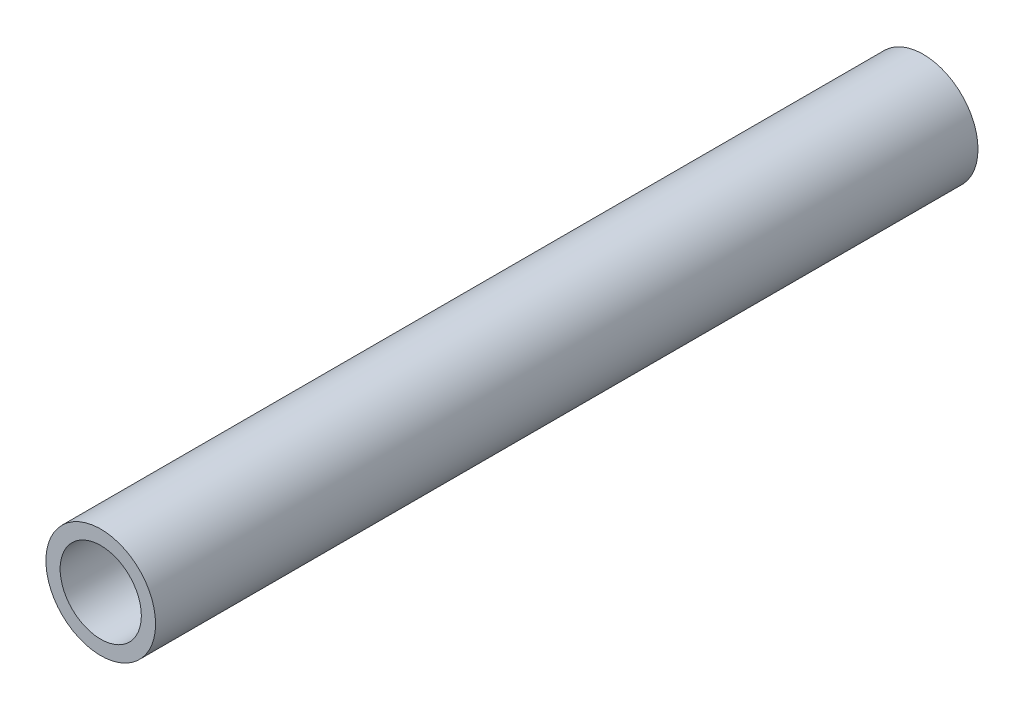
ISO-10303-21;
HEADER;
FILE_DESCRIPTION(('STEP AP214'),'2;1');
FILE_NAME('part.step','',(''),(''),'','','');
FILE_SCHEMA(('AUTOMOTIVE_DESIGN { 1 0 10303 214 1 1 1 1 }'));
ENDSEC;
DATA;
#1=APPLICATION_CONTEXT('core data for automotive mechanical design processes');
#2=APPLICATION_PROTOCOL_DEFINITION('international standard','automotive_design',2000,#1);
#3=PRODUCT_CONTEXT('',#1,'mechanical');
#4=PRODUCT('Part','Part','',(#3));
#5=PRODUCT_RELATED_PRODUCT_CATEGORY('part','',(#4));
#6=PRODUCT_DEFINITION_FORMATION('','',#4);
#7=PRODUCT_DEFINITION_CONTEXT('part definition',#1,'design');
#8=PRODUCT_DEFINITION('design','',#6,#7);
#9=PRODUCT_DEFINITION_SHAPE('','',#8);
#10=(LENGTH_UNIT() NAMED_UNIT(*) SI_UNIT(.MILLI.,.METRE.));
#11=(NAMED_UNIT(*) PLANE_ANGLE_UNIT() SI_UNIT($,.RADIAN.));
#12=(NAMED_UNIT(*) SI_UNIT($,.STERADIAN.) SOLID_ANGLE_UNIT());
#13=UNCERTAINTY_MEASURE_WITH_UNIT(LENGTH_MEASURE(1.E-05),#10,'distance_accuracy_value','');
#14=(GEOMETRIC_REPRESENTATION_CONTEXT(3) GLOBAL_UNCERTAINTY_ASSIGNED_CONTEXT((#13)) GLOBAL_UNIT_ASSIGNED_CONTEXT((#10,
#11,#12)) REPRESENTATION_CONTEXT('',''));
#15=CARTESIAN_POINT('',(0.,0.,0.));
#16=DIRECTION('',(0.,0.,1.));
#17=DIRECTION('',(1.,0.,0.));
#18=AXIS2_PLACEMENT_3D('',#15,#16,#17);
#19=CARTESIAN_POINT('',(0.,0.,80.));
#20=DIRECTION('',(0.,0.,1.));
#21=DIRECTION('',(1.,0.,0.));
#22=AXIS2_PLACEMENT_3D('',#19,#20,#21);
#23=PLANE('',#22);
#24=CARTESIAN_POINT('',(0.,0.,80.));
#25=DIRECTION('',(0.,0.,1.));
#26=DIRECTION('',(1.,0.,0.));
#27=AXIS2_PLACEMENT_3D('',#24,#25,#26);
#28=CIRCLE('',#27,10.668);
#29=CARTESIAN_POINT('',(10.668,0.,80.));
#30=VERTEX_POINT('',#29);
#31=EDGE_CURVE('E11',#30,#30,#28,.T.);
#32=ORIENTED_EDGE('',*,*,#31,.T.);
#33=EDGE_LOOP('',(#32));
#34=FACE_BOUND('',#33,.T.);
#35=CARTESIAN_POINT('',(0.,0.,80.));
#36=DIRECTION('',(0.,0.,1.));
#37=DIRECTION('',(1.,0.,0.));
#38=AXIS2_PLACEMENT_3D('',#35,#36,#37);
#39=CIRCLE('',#38,7.8994);
#40=CARTESIAN_POINT('',(7.8994,0.,80.));
#41=VERTEX_POINT('',#40);
#42=EDGE_CURVE('E50',#41,#41,#39,.T.);
#43=ORIENTED_EDGE('',*,*,#42,.F.);
#44=EDGE_LOOP('',(#43));
#45=FACE_BOUND('',#44,.T.);
#46=ADVANCED_FACE('F39',(#34,#45),#23,.T.);
#47=CARTESIAN_POINT('',(0.,0.,-80.));
#48=DIRECTION('',(0.,0.,1.));
#49=DIRECTION('',(1.,0.,0.));
#50=AXIS2_PLACEMENT_3D('',#47,#48,#49);
#51=PLANE('',#50);
#52=CARTESIAN_POINT('',(0.,0.,-80.));
#53=DIRECTION('',(0.,0.,1.));
#54=DIRECTION('',(1.,0.,0.));
#55=AXIS2_PLACEMENT_3D('',#52,#53,#54);
#56=CIRCLE('',#55,10.668);
#57=CARTESIAN_POINT('',(10.668,0.,-80.));
#58=VERTEX_POINT('',#57);
#59=EDGE_CURVE('E43',#58,#58,#56,.T.);
#60=ORIENTED_EDGE('',*,*,#59,.F.);
#61=EDGE_LOOP('',(#60));
#62=FACE_BOUND('',#61,.T.);
#63=CARTESIAN_POINT('',(0.,0.,-80.));
#64=DIRECTION('',(0.,0.,1.));
#65=DIRECTION('',(1.,0.,0.));
#66=AXIS2_PLACEMENT_3D('',#63,#64,#65);
#67=CIRCLE('',#66,7.8994);
#68=CARTESIAN_POINT('',(7.8994,0.,-80.));
#69=VERTEX_POINT('',#68);
#70=EDGE_CURVE('E52',#69,#69,#67,.T.);
#71=ORIENTED_EDGE('',*,*,#70,.T.);
#72=EDGE_LOOP('',(#71));
#73=FACE_BOUND('',#72,.T.);
#74=ADVANCED_FACE('F62',(#62,#73),#51,.F.);
#75=CARTESIAN_POINT('',(0.,0.,80.));
#76=DIRECTION('',(0.,0.,-1.));
#77=DIRECTION('',(-1.,0.,0.));
#78=AXIS2_PLACEMENT_3D('',#75,#76,#77);
#79=CYLINDRICAL_SURFACE('',#78,10.668);
#80=ORIENTED_EDGE('',*,*,#31,.F.);
#81=EDGE_LOOP('',(#80));
#82=FACE_BOUND('',#81,.T.);
#83=ORIENTED_EDGE('',*,*,#59,.T.);
#84=EDGE_LOOP('',(#83));
#85=FACE_BOUND('',#84,.T.);
#86=ADVANCED_FACE('F41',(#82,#85),#79,.T.);
#87=CARTESIAN_POINT('',(0.,0.,80.));
#88=DIRECTION('',(0.,0.,-1.));
#89=DIRECTION('',(-1.,0.,0.));
#90=AXIS2_PLACEMENT_3D('',#87,#88,#89);
#91=CYLINDRICAL_SURFACE('',#90,7.8994);
#92=ORIENTED_EDGE('',*,*,#42,.T.);
#93=EDGE_LOOP('',(#92));
#94=FACE_BOUND('',#93,.T.);
#95=ORIENTED_EDGE('',*,*,#70,.F.);
#96=EDGE_LOOP('',(#95));
#97=FACE_BOUND('',#96,.T.);
#98=ADVANCED_FACE('F58',(#94,#97),#91,.F.);
#99=CLOSED_SHELL('',(#46,#74,#86,#98));
#100=MANIFOLD_SOLID_BREP('B2',#99);
#101=ADVANCED_BREP_SHAPE_REPRESENTATION('',(#18,#100),#14);
#102=SHAPE_DEFINITION_REPRESENTATION(#9,#101);
ENDSEC;
END-ISO-10303-21;
